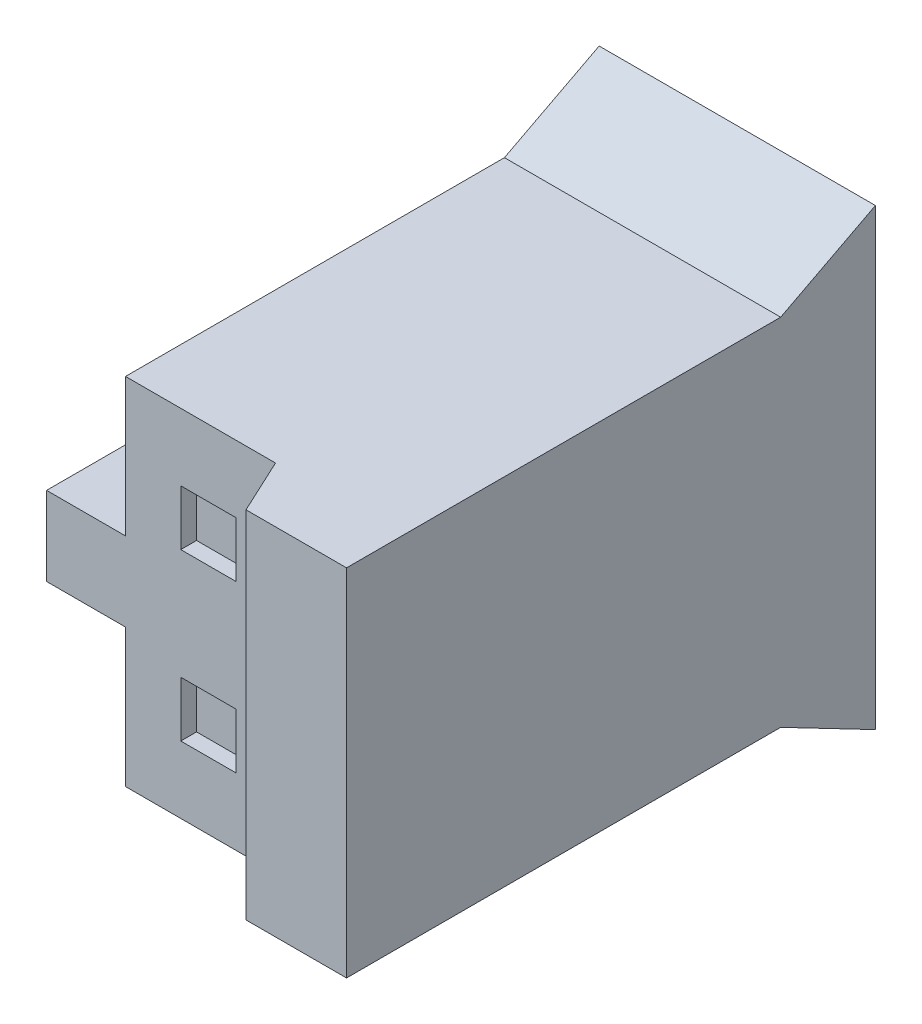
ISO-10303-21;
HEADER;
FILE_DESCRIPTION(('STEP AP214'),'2;1');
FILE_NAME('part.step','',(''),(''),'','','');
FILE_SCHEMA(('AUTOMOTIVE_DESIGN { 1 0 10303 214 1 1 1 1 }'));
ENDSEC;
DATA;
#1=APPLICATION_CONTEXT('core data for automotive mechanical design processes');
#2=APPLICATION_PROTOCOL_DEFINITION('international standard','automotive_design',2000,#1);
#3=PRODUCT_CONTEXT('',#1,'mechanical');
#4=PRODUCT('Part','Part','',(#3));
#5=PRODUCT_RELATED_PRODUCT_CATEGORY('part','',(#4));
#6=PRODUCT_DEFINITION_FORMATION('','',#4);
#7=PRODUCT_DEFINITION_CONTEXT('part definition',#1,'design');
#8=PRODUCT_DEFINITION('design','',#6,#7);
#9=PRODUCT_DEFINITION_SHAPE('','',#8);
#10=(LENGTH_UNIT() NAMED_UNIT(*) SI_UNIT(.MILLI.,.METRE.));
#11=(NAMED_UNIT(*) PLANE_ANGLE_UNIT() SI_UNIT($,.RADIAN.));
#12=(NAMED_UNIT(*) SI_UNIT($,.STERADIAN.) SOLID_ANGLE_UNIT());
#13=UNCERTAINTY_MEASURE_WITH_UNIT(LENGTH_MEASURE(1.E-05),#10,'distance_accuracy_value','');
#14=(GEOMETRIC_REPRESENTATION_CONTEXT(3) GLOBAL_UNCERTAINTY_ASSIGNED_CONTEXT((#13)) GLOBAL_UNIT_ASSIGNED_CONTEXT((#10,
#11,#12)) REPRESENTATION_CONTEXT('',''));
#15=CARTESIAN_POINT('',(0.,0.,0.));
#16=DIRECTION('',(0.,0.,1.));
#17=DIRECTION('',(1.,0.,0.));
#18=AXIS2_PLACEMENT_3D('',#15,#16,#17);
#19=CARTESIAN_POINT('',(-4.5,2.74999994039536,26.0000003427267));
#20=DIRECTION('',(-1.,0.,0.));
#21=DIRECTION('',(0.,0.,1.));
#22=AXIS2_PLACEMENT_3D('',#19,#20,#21);
#23=PLANE('',#22);
#24=DIRECTION('',(0.,1.,0.));
#25=VECTOR('',#24,1.);
#26=CARTESIAN_POINT('',(-4.5,2.74999994039536,29.0000003427267));
#27=LINE('',#26,#25);
#28=CARTESIAN_POINT('',(-4.5,2.24999994039536,29.0000003427267));
#29=VERTEX_POINT('',#28);
#30=CARTESIAN_POINT('',(-4.5,3.24999994039536,29.0000003427267));
#31=VERTEX_POINT('',#30);
#32=EDGE_CURVE('E155',#29,#31,#27,.T.);
#33=ORIENTED_EDGE('',*,*,#32,.T.);
#34=DIRECTION('',(0.,0.,1.));
#35=VECTOR('',#34,1.);
#36=CARTESIAN_POINT('',(-4.5,3.24999994039536,29.0000003427267));
#37=LINE('',#36,#35);
#38=CARTESIAN_POINT('',(-4.5,3.24999994039536,23.0000003427267));
#39=VERTEX_POINT('',#38);
#40=EDGE_CURVE('E178',#39,#31,#37,.T.);
#41=ORIENTED_EDGE('',*,*,#40,.F.);
#42=DIRECTION('',(0.,1.,0.));
#43=VECTOR('',#42,1.);
#44=CARTESIAN_POINT('',(-4.5,2.74999994039536,23.0000003427267));
#45=LINE('',#44,#43);
#46=CARTESIAN_POINT('',(-4.5,2.24999994039536,23.0000003427267));
#47=VERTEX_POINT('',#46);
#48=EDGE_CURVE('E20',#39,#47,#45,.F.);
#49=ORIENTED_EDGE('',*,*,#48,.T.);
#50=DIRECTION('',(0.,0.,-1.));
#51=VECTOR('',#50,1.);
#52=CARTESIAN_POINT('',(-4.5,2.24999994039536,23.0000003427267));
#53=LINE('',#52,#51);
#54=EDGE_CURVE('E164',#29,#47,#53,.T.);
#55=ORIENTED_EDGE('',*,*,#54,.F.);
#56=EDGE_LOOP('',(#33,#41,#49,#55));
#57=FACE_BOUND('',#56,.T.);
#58=ADVANCED_FACE('F17',(#57),#23,.T.);
#59=CARTESIAN_POINT('',(-2.45,3.80000008940697,28.8000003427267));
#60=DIRECTION('',(0.,0.,-1.));
#61=DIRECTION('',(-1.,0.,0.));
#62=AXIS2_PLACEMENT_3D('',#59,#60,#61);
#63=PLANE('',#62);
#64=DIRECTION('',(0.,1.,0.));
#65=VECTOR('',#64,1.);
#66=CARTESIAN_POINT('',(-2.1,4.15000008940697,28.8000003427267));
#67=LINE('',#66,#65);
#68=CARTESIAN_POINT('',(-2.1,3.45000008940697,28.8000003427267));
#69=VERTEX_POINT('',#68);
#70=CARTESIAN_POINT('',(-2.1,4.15000008940697,28.8000003427267));
#71=VERTEX_POINT('',#70);
#72=EDGE_CURVE('E181',#69,#71,#67,.T.);
#73=ORIENTED_EDGE('',*,*,#72,.T.);
#74=DIRECTION('',(1.,0.,0.));
#75=VECTOR('',#74,1.);
#76=CARTESIAN_POINT('',(-2.8,4.15000008940697,28.8000003427267));
#77=LINE('',#76,#75);
#78=CARTESIAN_POINT('',(-2.8,4.15000008940697,28.8000003427267));
#79=VERTEX_POINT('',#78);
#80=EDGE_CURVE('E194',#71,#79,#77,.F.);
#81=ORIENTED_EDGE('',*,*,#80,.T.);
#82=DIRECTION('',(0.,1.,0.));
#83=VECTOR('',#82,1.);
#84=CARTESIAN_POINT('',(-2.8,3.45000008940697,28.8000003427267));
#85=LINE('',#84,#83);
#86=CARTESIAN_POINT('',(-2.8,3.45000008940697,28.8000003427267));
#87=VERTEX_POINT('',#86);
#88=EDGE_CURVE('E187',#79,#87,#85,.F.);
#89=ORIENTED_EDGE('',*,*,#88,.T.);
#90=DIRECTION('',(1.,0.,0.));
#91=VECTOR('',#90,1.);
#92=CARTESIAN_POINT('',(-2.1,3.45000008940697,28.8000003427267));
#93=LINE('',#92,#91);
#94=EDGE_CURVE('E183',#87,#69,#93,.T.);
#95=ORIENTED_EDGE('',*,*,#94,.T.);
#96=EDGE_LOOP('',(#73,#81,#89,#95));
#97=FACE_BOUND('',#96,.T.);
#98=ADVANCED_FACE('F416',(#97),#63,.F.);
#99=CARTESIAN_POINT('',(-2.44999994604752,1.69999989671954,28.8000003427267));
#100=DIRECTION('',(0.,0.,-1.));
#101=DIRECTION('',(-1.,0.,0.));
#102=AXIS2_PLACEMENT_3D('',#99,#100,#101);
#103=PLANE('',#102);
#104=DIRECTION('',(0.999999999999999,5.13833134771094E-08,0.));
#105=VECTOR('',#104,1.);
#106=CARTESIAN_POINT('',(-2.09999992806336,1.3499999147037,28.8000003427267));
#107=LINE('',#106,#105);
#108=CARTESIAN_POINT('',(-2.79999992806335,1.34999989671954,28.8000003427267));
#109=VERTEX_POINT('',#108);
#110=CARTESIAN_POINT('',(-2.09999993705544,1.3499999147037,28.8000003427267));
#111=VERTEX_POINT('',#110);
#112=EDGE_CURVE('E198',#109,#111,#107,.T.);
#113=ORIENTED_EDGE('',*,*,#112,.T.);
#114=DIRECTION('',(-5.13833142701258E-08,0.999999999999999,0.));
#115=VECTOR('',#114,1.);
#116=CARTESIAN_POINT('',(-2.09999996403168,2.0499999147037,28.8000003427267));
#117=LINE('',#116,#115);
#118=CARTESIAN_POINT('',(-2.09999996403168,2.04999989671954,28.8000003427267));
#119=VERTEX_POINT('',#118);
#120=EDGE_CURVE('E211',#111,#119,#117,.T.);
#121=ORIENTED_EDGE('',*,*,#120,.T.);
#122=DIRECTION('',(-0.999999999999999,-5.13833150631423E-08,0.));
#123=VECTOR('',#122,1.);
#124=CARTESIAN_POINT('',(-2.79999996403167,2.04999987873538,28.8000003427267));
#125=LINE('',#124,#123);
#126=CARTESIAN_POINT('',(-2.79999994604751,2.04999987873538,28.8000003427267));
#127=VERTEX_POINT('',#126);
#128=EDGE_CURVE('E204',#119,#127,#125,.T.);
#129=ORIENTED_EDGE('',*,*,#128,.T.);
#130=DIRECTION('',(5.13833142701259E-08,-0.999999999999999,0.));
#131=VECTOR('',#130,1.);
#132=CARTESIAN_POINT('',(-2.79999992806335,1.34999987873538,28.8000003427267));
#133=LINE('',#132,#131);
#134=EDGE_CURVE('E200',#127,#109,#133,.T.);
#135=ORIENTED_EDGE('',*,*,#134,.T.);
#136=EDGE_LOOP('',(#113,#121,#129,#135));
#137=FACE_BOUND('',#136,.T.);
#138=ADVANCED_FACE('F350',(#137),#103,.F.);
#139=CARTESIAN_POINT('',(0.,2.24999994039536,23.0000003427267));
#140=DIRECTION('',(0.,-1.,0.));
#141=DIRECTION('',(0.,0.,-1.));
#142=AXIS2_PLACEMENT_3D('',#139,#140,#141);
#143=PLANE('',#142);
#144=ORIENTED_EDGE('',*,*,#54,.T.);
#145=DIRECTION('',(1.,0.,0.));
#146=VECTOR('',#145,1.);
#147=CARTESIAN_POINT('',(0.,2.24999994039536,23.0000003427267));
#148=LINE('',#147,#146);
#149=CARTESIAN_POINT('',(-3.5,2.24999994039536,23.0000003427267));
#150=VERTEX_POINT('',#149);
#151=EDGE_CURVE('E166',#47,#150,#148,.T.);
#152=ORIENTED_EDGE('',*,*,#151,.T.);
#153=DIRECTION('',(0.,0.,1.));
#154=VECTOR('',#153,1.);
#155=CARTESIAN_POINT('',(-3.5,2.24999994039536,26.0000003427267));
#156=LINE('',#155,#154);
#157=CARTESIAN_POINT('',(-3.5,2.24999994039536,29.0000003427267));
#158=VERTEX_POINT('',#157);
#159=EDGE_CURVE('E170',#158,#150,#156,.F.);
#160=ORIENTED_EDGE('',*,*,#159,.F.);
#161=DIRECTION('',(1.,0.,0.));
#162=VECTOR('',#161,1.);
#163=CARTESIAN_POINT('',(0.,2.24999994039536,29.0000003427267));
#164=LINE('',#163,#162);
#165=EDGE_CURVE('E158',#158,#29,#164,.F.);
#166=ORIENTED_EDGE('',*,*,#165,.T.);
#167=EDGE_LOOP('',(#144,#152,#160,#166));
#168=FACE_BOUND('',#167,.T.);
#169=ADVANCED_FACE('F168',(#168),#143,.T.);
#170=CARTESIAN_POINT('',(0.,3.24999994039536,29.0000003427267));
#171=DIRECTION('',(0.,1.,0.));
#172=DIRECTION('',(0.,0.,1.));
#173=AXIS2_PLACEMENT_3D('',#170,#171,#172);
#174=PLANE('',#173);
#175=ORIENTED_EDGE('',*,*,#40,.T.);
#176=DIRECTION('',(1.,0.,0.));
#177=VECTOR('',#176,1.);
#178=CARTESIAN_POINT('',(0.,3.24999994039536,29.0000003427267));
#179=LINE('',#178,#177);
#180=CARTESIAN_POINT('',(-3.5,3.24999994039536,29.0000003427267));
#181=VERTEX_POINT('',#180);
#182=EDGE_CURVE('E161',#31,#181,#179,.T.);
#183=ORIENTED_EDGE('',*,*,#182,.T.);
#184=DIRECTION('',(0.,0.,1.));
#185=VECTOR('',#184,1.);
#186=CARTESIAN_POINT('',(-3.5,3.24999994039536,26.0000003427267));
#187=LINE('',#186,#185);
#188=CARTESIAN_POINT('',(-3.5,3.24999994039536,23.0000003427267));
#189=VERTEX_POINT('',#188);
#190=EDGE_CURVE('E222',#189,#181,#187,.T.);
#191=ORIENTED_EDGE('',*,*,#190,.F.);
#192=DIRECTION('',(1.,0.,0.));
#193=VECTOR('',#192,1.);
#194=CARTESIAN_POINT('',(0.,3.24999994039536,23.0000003427267));
#195=LINE('',#194,#193);
#196=EDGE_CURVE('E175',#189,#39,#195,.F.);
#197=ORIENTED_EDGE('',*,*,#196,.T.);
#198=EDGE_LOOP('',(#175,#183,#191,#197));
#199=FACE_BOUND('',#198,.T.);
#200=ADVANCED_FACE('F338',(#199),#174,.T.);
#201=CARTESIAN_POINT('',(-2.1,4.15000008940697,29.0000003427267));
#202=DIRECTION('',(1.,0.,0.));
#203=DIRECTION('',(0.,0.,-1.));
#204=AXIS2_PLACEMENT_3D('',#201,#202,#203);
#205=PLANE('',#204);
#206=DIRECTION('',(0.,0.,1.));
#207=VECTOR('',#206,1.);
#208=CARTESIAN_POINT('',(-2.1,4.15000008940697,29.0000003427267));
#209=LINE('',#208,#207);
#210=CARTESIAN_POINT('',(-2.1,4.15000008940697,29.0000003427267));
#211=VERTEX_POINT('',#210);
#212=EDGE_CURVE('E191',#211,#71,#209,.F.);
#213=ORIENTED_EDGE('',*,*,#212,.T.);
#214=ORIENTED_EDGE('',*,*,#72,.F.);
#215=DIRECTION('',(0.,0.,-1.));
#216=VECTOR('',#215,1.);
#217=CARTESIAN_POINT('',(-2.1,3.45000008940697,29.0000003427267));
#218=LINE('',#217,#216);
#219=CARTESIAN_POINT('',(-2.1,3.45000008940697,29.0000003427267));
#220=VERTEX_POINT('',#219);
#221=EDGE_CURVE('E185',#69,#220,#218,.F.);
#222=ORIENTED_EDGE('',*,*,#221,.T.);
#223=DIRECTION('',(0.,1.,0.));
#224=VECTOR('',#223,1.);
#225=CARTESIAN_POINT('',(-2.1,0.499999940395356,29.0000003427267));
#226=LINE('',#225,#224);
#227=EDGE_CURVE('E231',#211,#220,#226,.F.);
#228=ORIENTED_EDGE('',*,*,#227,.F.);
#229=EDGE_LOOP('',(#213,#214,#222,#228));
#230=FACE_BOUND('',#229,.T.);
#231=ADVANCED_FACE('F340',(#230),#205,.F.);
#232=CARTESIAN_POINT('',(-2.1,3.45000008940697,29.0000003427267));
#233=DIRECTION('',(0.,-1.,0.));
#234=DIRECTION('',(0.,0.,-1.));
#235=AXIS2_PLACEMENT_3D('',#232,#233,#234);
#236=PLANE('',#235);
#237=ORIENTED_EDGE('',*,*,#221,.F.);
#238=ORIENTED_EDGE('',*,*,#94,.F.);
#239=DIRECTION('',(0.,0.,1.));
#240=VECTOR('',#239,1.);
#241=CARTESIAN_POINT('',(-2.8,3.45000008940697,29.0000003427267));
#242=LINE('',#241,#240);
#243=CARTESIAN_POINT('',(-2.8,3.45000008940697,29.0000003427267));
#244=VERTEX_POINT('',#243);
#245=EDGE_CURVE('E189',#87,#244,#242,.T.);
#246=ORIENTED_EDGE('',*,*,#245,.T.);
#247=DIRECTION('',(1.,0.,0.));
#248=VECTOR('',#247,1.);
#249=CARTESIAN_POINT('',(0.,3.45000008940697,29.0000003427267));
#250=LINE('',#249,#248);
#251=EDGE_CURVE('E234',#220,#244,#250,.F.);
#252=ORIENTED_EDGE('',*,*,#251,.F.);
#253=EDGE_LOOP('',(#237,#238,#246,#252));
#254=FACE_BOUND('',#253,.T.);
#255=ADVANCED_FACE('F347',(#254),#236,.F.);
#256=CARTESIAN_POINT('',(-2.8,3.45000008940697,29.0000003427267));
#257=DIRECTION('',(-1.,0.,0.));
#258=DIRECTION('',(0.,0.,1.));
#259=AXIS2_PLACEMENT_3D('',#256,#257,#258);
#260=PLANE('',#259);
#261=ORIENTED_EDGE('',*,*,#245,.F.);
#262=ORIENTED_EDGE('',*,*,#88,.F.);
#263=DIRECTION('',(0.,0.,1.));
#264=VECTOR('',#263,1.);
#265=CARTESIAN_POINT('',(-2.8,4.15000008940697,29.0000003427267));
#266=LINE('',#265,#264);
#267=CARTESIAN_POINT('',(-2.8,4.15000008940697,29.0000003427267));
#268=VERTEX_POINT('',#267);
#269=EDGE_CURVE('E196',#79,#268,#266,.T.);
#270=ORIENTED_EDGE('',*,*,#269,.T.);
#271=DIRECTION('',(0.,1.,0.));
#272=VECTOR('',#271,1.);
#273=CARTESIAN_POINT('',(-2.8,0.499999940395356,29.0000003427267));
#274=LINE('',#273,#272);
#275=EDGE_CURVE('E237',#244,#268,#274,.T.);
#276=ORIENTED_EDGE('',*,*,#275,.F.);
#277=EDGE_LOOP('',(#261,#262,#270,#276));
#278=FACE_BOUND('',#277,.T.);
#279=ADVANCED_FACE('F399',(#278),#260,.F.);
#280=CARTESIAN_POINT('',(-2.8,4.15000008940697,29.0000003427267));
#281=DIRECTION('',(0.,1.,0.));
#282=DIRECTION('',(0.,0.,1.));
#283=AXIS2_PLACEMENT_3D('',#280,#281,#282);
#284=PLANE('',#283);
#285=ORIENTED_EDGE('',*,*,#269,.F.);
#286=ORIENTED_EDGE('',*,*,#80,.F.);
#287=ORIENTED_EDGE('',*,*,#212,.F.);
#288=DIRECTION('',(1.,0.,0.));
#289=VECTOR('',#288,1.);
#290=CARTESIAN_POINT('',(0.,4.15000008940697,29.0000003427267));
#291=LINE('',#290,#289);
#292=EDGE_CURVE('E240',#268,#211,#291,.T.);
#293=ORIENTED_EDGE('',*,*,#292,.F.);
#294=EDGE_LOOP('',(#285,#286,#287,#293));
#295=FACE_BOUND('',#294,.T.);
#296=ADVANCED_FACE('F395',(#295),#284,.F.);
#297=CARTESIAN_POINT('',(-2.09999992806336,1.3499999147037,29.0000003427267));
#298=DIRECTION('',(5.13833134771094E-08,-0.999999999999999,0.));
#299=DIRECTION('',(0.999999999999999,5.13833134771094E-08,0.));
#300=AXIS2_PLACEMENT_3D('',#297,#298,#299);
#301=PLANE('',#300);
#302=DIRECTION('',(0.,0.,1.));
#303=VECTOR('',#302,1.);
#304=CARTESIAN_POINT('',(-2.09999992806336,1.3499999147037,29.0000003427267));
#305=LINE('',#304,#303);
#306=CARTESIAN_POINT('',(-2.09999993705544,1.3499999147037,29.0000003427267));
#307=VERTEX_POINT('',#306);
#308=EDGE_CURVE('E208',#307,#111,#305,.F.);
#309=ORIENTED_EDGE('',*,*,#308,.T.);
#310=ORIENTED_EDGE('',*,*,#112,.F.);
#311=DIRECTION('',(0.,0.,1.));
#312=VECTOR('',#311,1.);
#313=CARTESIAN_POINT('',(-2.79999992806335,1.34999987873538,29.0000003427267));
#314=LINE('',#313,#312);
#315=CARTESIAN_POINT('',(-2.79999992806335,1.34999988772746,29.0000003427267));
#316=VERTEX_POINT('',#315);
#317=EDGE_CURVE('E202',#109,#316,#314,.T.);
#318=ORIENTED_EDGE('',*,*,#317,.T.);
#319=DIRECTION('',(1.,0.,0.));
#320=VECTOR('',#319,1.);
#321=CARTESIAN_POINT('',(0.,1.3499999147037,29.0000003427267));
#322=LINE('',#321,#320);
#323=EDGE_CURVE('E243',#307,#316,#322,.F.);
#324=ORIENTED_EDGE('',*,*,#323,.F.);
#325=EDGE_LOOP('',(#309,#310,#318,#324));
#326=FACE_BOUND('',#325,.T.);
#327=ADVANCED_FACE('F391',(#326),#301,.F.);
#328=CARTESIAN_POINT('',(-2.79999992806335,1.34999987873538,29.0000003427267));
#329=DIRECTION('',(-0.999999999999999,-5.13833142701259E-08,0.));
#330=DIRECTION('',(5.13833142701259E-08,-0.999999999999999,0.));
#331=AXIS2_PLACEMENT_3D('',#328,#329,#330);
#332=PLANE('',#331);
#333=ORIENTED_EDGE('',*,*,#317,.F.);
#334=ORIENTED_EDGE('',*,*,#134,.F.);
#335=DIRECTION('',(0.,0.,1.));
#336=VECTOR('',#335,1.);
#337=CARTESIAN_POINT('',(-2.79999996403167,2.04999987873538,29.0000003427267));
#338=LINE('',#337,#336);
#339=CARTESIAN_POINT('',(-2.79999995503959,2.04999987873538,29.0000003427267));
#340=VERTEX_POINT('',#339);
#341=EDGE_CURVE('E206',#127,#340,#338,.T.);
#342=ORIENTED_EDGE('',*,*,#341,.T.);
#343=DIRECTION('',(0.,1.,0.));
#344=VECTOR('',#343,1.);
#345=CARTESIAN_POINT('',(-2.79999992806335,0.499999940395356,29.0000003427267));
#346=LINE('',#345,#344);
#347=EDGE_CURVE('E246',#316,#340,#346,.T.);
#348=ORIENTED_EDGE('',*,*,#347,.F.);
#349=EDGE_LOOP('',(#333,#334,#342,#348));
#350=FACE_BOUND('',#349,.T.);
#351=ADVANCED_FACE('F387',(#350),#332,.F.);
#352=CARTESIAN_POINT('',(-2.79999996403167,2.04999987873538,29.0000003427267));
#353=DIRECTION('',(-5.13833150631423E-08,0.999999999999999,0.));
#354=DIRECTION('',(-0.999999999999999,-5.13833150631423E-08,0.));
#355=AXIS2_PLACEMENT_3D('',#352,#353,#354);
#356=PLANE('',#355);
#357=ORIENTED_EDGE('',*,*,#341,.F.);
#358=ORIENTED_EDGE('',*,*,#128,.F.);
#359=DIRECTION('',(0.,0.,1.));
#360=VECTOR('',#359,1.);
#361=CARTESIAN_POINT('',(-2.09999996403168,2.0499999147037,29.0000003427267));
#362=LINE('',#361,#360);
#363=CARTESIAN_POINT('',(-2.09999996403168,2.04999990571162,29.0000003427267));
#364=VERTEX_POINT('',#363);
#365=EDGE_CURVE('E213',#119,#364,#362,.T.);
#366=ORIENTED_EDGE('',*,*,#365,.T.);
#367=DIRECTION('',(1.,0.,0.));
#368=VECTOR('',#367,1.);
#369=CARTESIAN_POINT('',(0.,2.04999987873538,29.0000003427267));
#370=LINE('',#369,#368);
#371=EDGE_CURVE('E249',#340,#364,#370,.T.);
#372=ORIENTED_EDGE('',*,*,#371,.F.);
#373=EDGE_LOOP('',(#357,#358,#366,#372));
#374=FACE_BOUND('',#373,.T.);
#375=ADVANCED_FACE('F383',(#374),#356,.F.);
#376=CARTESIAN_POINT('',(-2.09999996403168,2.0499999147037,29.0000003427267));
#377=DIRECTION('',(0.999999999999999,5.13833142701258E-08,0.));
#378=DIRECTION('',(-5.13833142701258E-08,0.999999999999999,0.));
#379=AXIS2_PLACEMENT_3D('',#376,#377,#378);
#380=PLANE('',#379);
#381=ORIENTED_EDGE('',*,*,#365,.F.);
#382=ORIENTED_EDGE('',*,*,#120,.F.);
#383=ORIENTED_EDGE('',*,*,#308,.F.);
#384=DIRECTION('',(0.,1.,0.));
#385=VECTOR('',#384,1.);
#386=CARTESIAN_POINT('',(-2.09999996403168,0.499999940395356,29.0000003427267));
#387=LINE('',#386,#385);
#388=EDGE_CURVE('E252',#364,#307,#387,.F.);
#389=ORIENTED_EDGE('',*,*,#388,.F.);
#390=EDGE_LOOP('',(#381,#382,#383,#389));
#391=FACE_BOUND('',#390,.T.);
#392=ADVANCED_FACE('F380',(#391),#380,.F.);
#393=CARTESIAN_POINT('',(0.,-0.125000059604645,23.0000003427267));
#394=DIRECTION('',(0.,-0.886914084166979,0.461934418836969));
#395=DIRECTION('',(0.,-0.461934418836969,-0.886914084166979));
#396=AXIS2_PLACEMENT_3D('',#393,#394,#395);
#397=PLANE('',#396);
#398=DIRECTION('',(0.,0.461934418836969,0.886914084166979));
#399=VECTOR('',#398,1.);
#400=CARTESIAN_POINT('',(-3.5,-0.125000059604645,23.0000003427267));
#401=LINE('',#400,#399);
#402=CARTESIAN_POINT('',(-3.5,-0.125000059604645,23.0000003427267));
#403=VERTEX_POINT('',#402);
#404=CARTESIAN_POINT('',(-3.5,0.499999940395356,24.2000003427267));
#405=VERTEX_POINT('',#404);
#406=EDGE_CURVE('E218',#403,#405,#401,.T.);
#407=ORIENTED_EDGE('',*,*,#406,.F.);
#408=DIRECTION('',(-1.,0.,0.));
#409=VECTOR('',#408,1.);
#410=CARTESIAN_POINT('',(0.,-0.125000059604645,23.0000003427267));
#411=LINE('',#410,#409);
#412=CARTESIAN_POINT('',(0.,-0.125000059604645,23.0000003427267));
#413=VERTEX_POINT('',#412);
#414=EDGE_CURVE('E269',#413,#403,#411,.T.);
#415=ORIENTED_EDGE('',*,*,#414,.F.);
#416=DIRECTION('',(0.,-0.461934418836969,-0.886914084166979));
#417=VECTOR('',#416,1.);
#418=CARTESIAN_POINT('',(0.,-0.125000059604645,23.0000003427267));
#419=LINE('',#418,#417);
#420=CARTESIAN_POINT('',(0.,0.499999940395356,24.2000003427267));
#421=VERTEX_POINT('',#420);
#422=EDGE_CURVE('E215',#413,#421,#419,.F.);
#423=ORIENTED_EDGE('',*,*,#422,.T.);
#424=DIRECTION('',(1.,0.,0.));
#425=VECTOR('',#424,1.);
#426=CARTESIAN_POINT('',(0.,0.499999940395356,24.2000003427267));
#427=LINE('',#426,#425);
#428=EDGE_CURVE('E266',#405,#421,#427,.T.);
#429=ORIENTED_EDGE('',*,*,#428,.F.);
#430=EDGE_LOOP('',(#407,#415,#423,#429));
#431=FACE_BOUND('',#430,.T.);
#432=ADVANCED_FACE('F333',(#431),#397,.T.);
#433=CARTESIAN_POINT('',(-3.5,1.06249994039536,26.0000003427267));
#434=DIRECTION('',(-1.,0.,0.));
#435=DIRECTION('',(0.,0.,1.));
#436=AXIS2_PLACEMENT_3D('',#433,#434,#435);
#437=PLANE('',#436);
#438=DIRECTION('',(0.,1.,0.));
#439=VECTOR('',#438,1.);
#440=CARTESIAN_POINT('',(-3.5,2.24999994039536,23.0000003427267));
#441=LINE('',#440,#439);
#442=EDGE_CURVE('E272',#403,#150,#441,.T.);
#443=ORIENTED_EDGE('',*,*,#442,.F.);
#444=ORIENTED_EDGE('',*,*,#406,.T.);
#445=DIRECTION('',(0.,0.,-1.));
#446=VECTOR('',#445,1.);
#447=CARTESIAN_POINT('',(-3.5,0.499999940395356,24.2000003427267));
#448=LINE('',#447,#446);
#449=CARTESIAN_POINT('',(-3.5,0.499999940395356,29.0000003427267));
#450=VERTEX_POINT('',#449);
#451=EDGE_CURVE('E263',#450,#405,#448,.T.);
#452=ORIENTED_EDGE('',*,*,#451,.F.);
#453=DIRECTION('',(0.,1.,0.));
#454=VECTOR('',#453,1.);
#455=CARTESIAN_POINT('',(-3.5,0.499999940395356,29.0000003427267));
#456=LINE('',#455,#454);
#457=EDGE_CURVE('E229',#158,#450,#456,.F.);
#458=ORIENTED_EDGE('',*,*,#457,.F.);
#459=ORIENTED_EDGE('',*,*,#159,.T.);
#460=EDGE_LOOP('',(#443,#444,#452,#458,#459));
#461=FACE_BOUND('',#460,.T.);
#462=ADVANCED_FACE('F374',(#461),#437,.T.);
#463=CARTESIAN_POINT('',(0.,4.99999994039536,24.2000003427267));
#464=DIRECTION('',(0.,0.886914084166979,0.461934418836969));
#465=DIRECTION('',(0.,-0.461934418836969,0.886914084166979));
#466=AXIS2_PLACEMENT_3D('',#463,#464,#465);
#467=PLANE('',#466);
#468=DIRECTION('',(0.,0.461934418836969,-0.886914084166979));
#469=VECTOR('',#468,1.);
#470=CARTESIAN_POINT('',(-3.5,4.99999994039536,24.2000003427267));
#471=LINE('',#470,#469);
#472=CARTESIAN_POINT('',(-3.5,4.99999997764826,24.2000002712011));
#473=VERTEX_POINT('',#472);
#474=CARTESIAN_POINT('',(-3.5,5.62499994039536,23.0000003427267));
#475=VERTEX_POINT('',#474);
#476=EDGE_CURVE('E225',#473,#475,#471,.T.);
#477=ORIENTED_EDGE('',*,*,#476,.F.);
#478=DIRECTION('',(1.,0.,0.));
#479=VECTOR('',#478,1.);
#480=CARTESIAN_POINT('',(0.,4.99999994039536,24.2000003427267));
#481=LINE('',#480,#479);
#482=CARTESIAN_POINT('',(0.,4.99999994039536,24.2000003427267));
#483=VERTEX_POINT('',#482);
#484=EDGE_CURVE('E281',#483,#473,#481,.F.);
#485=ORIENTED_EDGE('',*,*,#484,.F.);
#486=DIRECTION('',(0.,-0.461934418836969,0.886914084166979));
#487=VECTOR('',#486,1.);
#488=CARTESIAN_POINT('',(0.,4.99999994039536,24.2000003427267));
#489=LINE('',#488,#487);
#490=CARTESIAN_POINT('',(0.,5.62499994039536,23.0000003427267));
#491=VERTEX_POINT('',#490);
#492=EDGE_CURVE('E220',#483,#491,#489,.F.);
#493=ORIENTED_EDGE('',*,*,#492,.T.);
#494=DIRECTION('',(-1.,0.,0.));
#495=VECTOR('',#494,1.);
#496=CARTESIAN_POINT('',(0.,5.62499994039536,23.0000003427267));
#497=LINE('',#496,#495);
#498=EDGE_CURVE('E278',#475,#491,#497,.F.);
#499=ORIENTED_EDGE('',*,*,#498,.F.);
#500=EDGE_LOOP('',(#477,#485,#493,#499));
#501=FACE_BOUND('',#500,.T.);
#502=ADVANCED_FACE('F312',(#501),#467,.T.);
#503=CARTESIAN_POINT('',(-3.5,4.43749994039536,26.0000003427267));
#504=DIRECTION('',(-1.,0.,0.));
#505=DIRECTION('',(0.,0.,1.));
#506=AXIS2_PLACEMENT_3D('',#503,#504,#505);
#507=PLANE('',#506);
#508=DIRECTION('',(0.,0.,1.));
#509=VECTOR('',#508,1.);
#510=CARTESIAN_POINT('',(-3.5,4.99999994039536,29.0000003427267));
#511=LINE('',#510,#509);
#512=CARTESIAN_POINT('',(-3.5,5.00000005215407,29.0000003427267));
#513=VERTEX_POINT('',#512);
#514=EDGE_CURVE('E284',#473,#513,#511,.T.);
#515=ORIENTED_EDGE('',*,*,#514,.F.);
#516=ORIENTED_EDGE('',*,*,#476,.T.);
#517=DIRECTION('',(0.,1.,0.));
#518=VECTOR('',#517,1.);
#519=CARTESIAN_POINT('',(-3.5,2.24999994039536,23.0000003427267));
#520=LINE('',#519,#518);
#521=EDGE_CURVE('E275',#189,#475,#520,.T.);
#522=ORIENTED_EDGE('',*,*,#521,.F.);
#523=ORIENTED_EDGE('',*,*,#190,.T.);
#524=DIRECTION('',(0.,1.,0.));
#525=VECTOR('',#524,1.);
#526=CARTESIAN_POINT('',(-3.5,0.499999940395356,29.0000003427267));
#527=LINE('',#526,#525);
#528=EDGE_CURVE('E227',#513,#181,#527,.F.);
#529=ORIENTED_EDGE('',*,*,#528,.F.);
#530=EDGE_LOOP('',(#515,#516,#522,#523,#529));
#531=FACE_BOUND('',#530,.T.);
#532=ADVANCED_FACE('F316',(#531),#507,.T.);
#533=CARTESIAN_POINT('',(0.,0.499999940395356,29.0000003427267));
#534=DIRECTION('',(0.,0.,1.));
#535=DIRECTION('',(1.,0.,0.));
#536=AXIS2_PLACEMENT_3D('',#533,#534,#535);
#537=PLANE('',#536);
#538=ORIENTED_EDGE('',*,*,#371,.T.);
#539=ORIENTED_EDGE('',*,*,#388,.T.);
#540=ORIENTED_EDGE('',*,*,#323,.T.);
#541=ORIENTED_EDGE('',*,*,#347,.T.);
#542=EDGE_LOOP('',(#538,#539,#540,#541));
#543=FACE_BOUND('',#542,.T.);
#544=ORIENTED_EDGE('',*,*,#275,.T.);
#545=ORIENTED_EDGE('',*,*,#292,.T.);
#546=ORIENTED_EDGE('',*,*,#227,.T.);
#547=ORIENTED_EDGE('',*,*,#251,.T.);
#548=EDGE_LOOP('',(#544,#545,#546,#547));
#549=FACE_BOUND('',#548,.T.);
#550=ORIENTED_EDGE('',*,*,#457,.T.);
#551=DIRECTION('',(1.,0.,0.));
#552=VECTOR('',#551,1.);
#553=CARTESIAN_POINT('',(0.,0.499999940395356,29.0000003427267));
#554=LINE('',#553,#552);
#555=CARTESIAN_POINT('',(-1.6,0.499999940395356,29.0000003427267));
#556=VERTEX_POINT('',#555);
#557=EDGE_CURVE('E260',#556,#450,#554,.F.);
#558=ORIENTED_EDGE('',*,*,#557,.F.);
#559=DIRECTION('',(0.,1.,0.));
#560=VECTOR('',#559,1.);
#561=CARTESIAN_POINT('',(-1.59999999999999,2.75000001490116,29.0000003427267));
#562=LINE('',#561,#560);
#563=CARTESIAN_POINT('',(-1.6,5.00000001490116,29.0000003427267));
#564=VERTEX_POINT('',#563);
#565=EDGE_CURVE('E255',#564,#556,#562,.F.);
#566=ORIENTED_EDGE('',*,*,#565,.F.);
#567=DIRECTION('',(1.,0.,0.));
#568=VECTOR('',#567,1.);
#569=CARTESIAN_POINT('',(0.,4.99999994039536,29.0000003427267));
#570=LINE('',#569,#568);
#571=EDGE_CURVE('E287',#513,#564,#570,.T.);
#572=ORIENTED_EDGE('',*,*,#571,.F.);
#573=ORIENTED_EDGE('',*,*,#528,.T.);
#574=ORIENTED_EDGE('',*,*,#182,.F.);
#575=ORIENTED_EDGE('',*,*,#32,.F.);
#576=ORIENTED_EDGE('',*,*,#165,.F.);
#577=EDGE_LOOP('',(#550,#558,#566,#572,#573,#574,#575,#576));
#578=FACE_BOUND('',#577,.T.);
#579=ADVANCED_FACE('F156',(#543,#549,#578),#537,.T.);
#580=CARTESIAN_POINT('',(-1.45208360839076,2.75000001490116,29.3172080681895));
#581=DIRECTION('',(-0.90630778703665,0.,0.422618261740699));
#582=DIRECTION('',(0.422618261740699,0.,0.90630778703665));
#583=AXIS2_PLACEMENT_3D('',#580,#581,#582);
#584=PLANE('',#583);
#585=DIRECTION('',(-0.422618261740701,0.,-0.906307787036649));
#586=VECTOR('',#585,1.);
#587=CARTESIAN_POINT('',(-1.2735846392915,0.499999940395356,29.7000003427267));
#588=LINE('',#587,#586);
#589=CARTESIAN_POINT('',(-1.2735846392915,0.499999940395356,29.7000003427267));
#590=VERTEX_POINT('',#589);
#591=EDGE_CURVE('E257',#590,#556,#588,.T.);
#592=ORIENTED_EDGE('',*,*,#591,.F.);
#593=DIRECTION('',(0.,1.,0.));
#594=VECTOR('',#593,1.);
#595=CARTESIAN_POINT('',(-1.2735846392915,0.499999940395356,29.7000003427267));
#596=LINE('',#595,#594);
#597=CARTESIAN_POINT('',(-1.2735846392915,4.99999997764826,29.7000003427267));
#598=VERTEX_POINT('',#597);
#599=EDGE_CURVE('E293',#598,#590,#596,.F.);
#600=ORIENTED_EDGE('',*,*,#599,.F.);
#601=DIRECTION('',(0.422618261740701,0.,0.906307787036649));
#602=VECTOR('',#601,1.);
#603=CARTESIAN_POINT('',(-1.6,4.99999994039536,29.0000003427267));
#604=LINE('',#603,#602);
#605=EDGE_CURVE('E290',#564,#598,#604,.T.);
#606=ORIENTED_EDGE('',*,*,#605,.F.);
#607=ORIENTED_EDGE('',*,*,#565,.T.);
#608=EDGE_LOOP('',(#592,#600,#606,#607));
#609=FACE_BOUND('',#608,.T.);
#610=ADVANCED_FACE('F323',(#609),#584,.T.);
#611=CARTESIAN_POINT('',(0.,0.499999940395356,24.2000003427267));
#612=DIRECTION('',(0.,-1.,0.));
#613=DIRECTION('',(0.,0.,-1.));
#614=AXIS2_PLACEMENT_3D('',#611,#612,#613);
#615=PLANE('',#614);
#616=ORIENTED_EDGE('',*,*,#451,.T.);
#617=ORIENTED_EDGE('',*,*,#428,.T.);
#618=DIRECTION('',(0.,0.,-1.));
#619=VECTOR('',#618,1.);
#620=CARTESIAN_POINT('',(0.,0.499999940395356,26.0000003427267));
#621=LINE('',#620,#619);
#622=CARTESIAN_POINT('',(0.,0.499999940395356,29.7000003427267));
#623=VERTEX_POINT('',#622);
#624=EDGE_CURVE('E299',#623,#421,#621,.T.);
#625=ORIENTED_EDGE('',*,*,#624,.F.);
#626=DIRECTION('',(1.,0.,0.));
#627=VECTOR('',#626,1.);
#628=CARTESIAN_POINT('',(0.,0.499999940395356,29.7000003427267));
#629=LINE('',#628,#627);
#630=EDGE_CURVE('E296',#590,#623,#629,.T.);
#631=ORIENTED_EDGE('',*,*,#630,.F.);
#632=ORIENTED_EDGE('',*,*,#591,.T.);
#633=ORIENTED_EDGE('',*,*,#557,.T.);
#634=EDGE_LOOP('',(#616,#617,#625,#631,#632,#633));
#635=FACE_BOUND('',#634,.T.);
#636=ADVANCED_FACE('F328',(#635),#615,.T.);
#637=CARTESIAN_POINT('',(0.,2.24999994039536,23.0000003427267));
#638=DIRECTION('',(0.,0.,-1.));
#639=DIRECTION('',(-1.,0.,0.));
#640=AXIS2_PLACEMENT_3D('',#637,#638,#639);
#641=PLANE('',#640);
#642=ORIENTED_EDGE('',*,*,#521,.T.);
#643=ORIENTED_EDGE('',*,*,#498,.T.);
#644=DIRECTION('',(0.,1.,0.));
#645=VECTOR('',#644,1.);
#646=CARTESIAN_POINT('',(0.,1.06249994039536,23.0000003427267));
#647=LINE('',#646,#645);
#648=EDGE_CURVE('E302',#413,#491,#647,.T.);
#649=ORIENTED_EDGE('',*,*,#648,.F.);
#650=ORIENTED_EDGE('',*,*,#414,.T.);
#651=ORIENTED_EDGE('',*,*,#442,.T.);
#652=ORIENTED_EDGE('',*,*,#151,.F.);
#653=ORIENTED_EDGE('',*,*,#48,.F.);
#654=ORIENTED_EDGE('',*,*,#196,.F.);
#655=EDGE_LOOP('',(#642,#643,#649,#650,#651,#652,#653,#654));
#656=FACE_BOUND('',#655,.T.);
#657=ADVANCED_FACE('F336',(#656),#641,.T.);
#658=CARTESIAN_POINT('',(0.,4.99999994039536,29.0000003427267));
#659=DIRECTION('',(0.,1.,0.));
#660=DIRECTION('',(0.,0.,1.));
#661=AXIS2_PLACEMENT_3D('',#658,#659,#660);
#662=PLANE('',#661);
#663=ORIENTED_EDGE('',*,*,#605,.T.);
#664=DIRECTION('',(1.,0.,0.));
#665=VECTOR('',#664,1.);
#666=CARTESIAN_POINT('',(0.,5.00000008940697,29.7000003427267));
#667=LINE('',#666,#665);
#668=CARTESIAN_POINT('',(0.,4.99999997764826,29.7000003427267));
#669=VERTEX_POINT('',#668);
#670=EDGE_CURVE('E35',#669,#598,#667,.F.);
#671=ORIENTED_EDGE('',*,*,#670,.F.);
#672=DIRECTION('',(0.,0.,-1.));
#673=VECTOR('',#672,1.);
#674=CARTESIAN_POINT('',(0.,4.99999994039536,26.0000003427267));
#675=LINE('',#674,#673);
#676=EDGE_CURVE('E26',#483,#669,#675,.F.);
#677=ORIENTED_EDGE('',*,*,#676,.F.);
#678=ORIENTED_EDGE('',*,*,#484,.T.);
#679=ORIENTED_EDGE('',*,*,#514,.T.);
#680=ORIENTED_EDGE('',*,*,#571,.T.);
#681=EDGE_LOOP('',(#663,#671,#677,#678,#679,#680));
#682=FACE_BOUND('',#681,.T.);
#683=ADVANCED_FACE('F309',(#682),#662,.T.);
#684=CARTESIAN_POINT('',(0.,0.499999940395356,29.7000003427267));
#685=DIRECTION('',(0.,0.,1.));
#686=DIRECTION('',(1.,0.,0.));
#687=AXIS2_PLACEMENT_3D('',#684,#685,#686);
#688=PLANE('',#687);
#689=ORIENTED_EDGE('',*,*,#599,.T.);
#690=ORIENTED_EDGE('',*,*,#630,.T.);
#691=DIRECTION('',(0.,1.,0.));
#692=VECTOR('',#691,1.);
#693=CARTESIAN_POINT('',(0.,1.06249994039536,29.7000003427267));
#694=LINE('',#693,#692);
#695=EDGE_CURVE('E11',#669,#623,#694,.F.);
#696=ORIENTED_EDGE('',*,*,#695,.F.);
#697=ORIENTED_EDGE('',*,*,#670,.T.);
#698=EDGE_LOOP('',(#689,#690,#696,#697));
#699=FACE_BOUND('',#698,.T.);
#700=ADVANCED_FACE('F326',(#699),#688,.T.);
#701=CARTESIAN_POINT('',(0.,1.06249994039536,26.0000003427267));
#702=DIRECTION('',(1.,0.,0.));
#703=DIRECTION('',(0.,0.,-1.));
#704=AXIS2_PLACEMENT_3D('',#701,#702,#703);
#705=PLANE('',#704);
#706=ORIENTED_EDGE('',*,*,#676,.T.);
#707=ORIENTED_EDGE('',*,*,#695,.T.);
#708=ORIENTED_EDGE('',*,*,#624,.T.);
#709=ORIENTED_EDGE('',*,*,#422,.F.);
#710=ORIENTED_EDGE('',*,*,#648,.T.);
#711=ORIENTED_EDGE('',*,*,#492,.F.);
#712=EDGE_LOOP('',(#706,#707,#708,#709,#710,#711));
#713=FACE_BOUND('',#712,.T.);
#714=ADVANCED_FACE('F307',(#713),#705,.T.);
#715=CLOSED_SHELL('',(#58,#98,#138,#169,#200,#231,#255,#279,#296,#327,#351,#375,#392,#432,#462,
#502,#532,#579,#610,#636,#657,#683,#700,#714));
#716=MANIFOLD_SOLID_BREP('B1',#715);
#717=ADVANCED_BREP_SHAPE_REPRESENTATION('',(#18,#716),#14);
#718=SHAPE_DEFINITION_REPRESENTATION(#9,#717);
ENDSEC;
END-ISO-10303-21;
